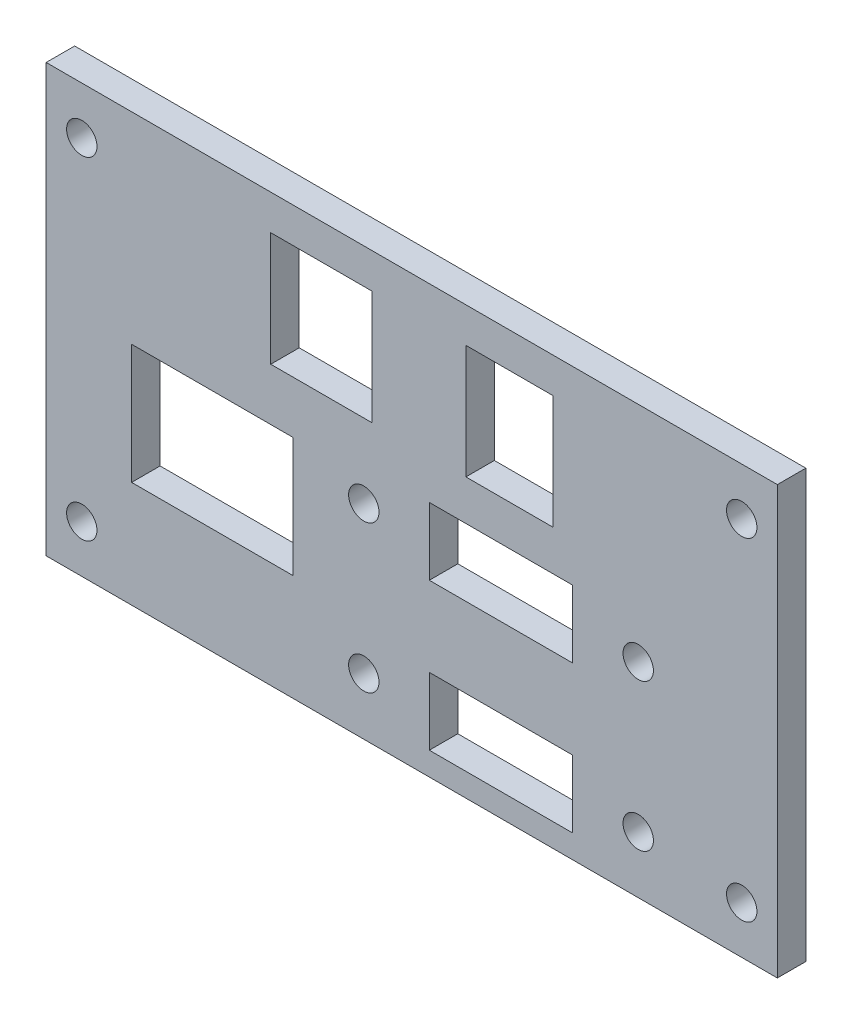
ISO-10303-21;
HEADER;
FILE_DESCRIPTION(('STEP AP214'),'2;1');
FILE_NAME('part.step','',(''),(''),'','','');
FILE_SCHEMA(('AUTOMOTIVE_DESIGN { 1 0 10303 214 1 1 1 1 }'));
ENDSEC;
DATA;
#1=APPLICATION_CONTEXT('core data for automotive mechanical design processes');
#2=APPLICATION_PROTOCOL_DEFINITION('international standard','automotive_design',2000,#1);
#3=PRODUCT_CONTEXT('',#1,'mechanical');
#4=PRODUCT('Part','Part','',(#3));
#5=PRODUCT_RELATED_PRODUCT_CATEGORY('part','',(#4));
#6=PRODUCT_DEFINITION_FORMATION('','',#4);
#7=PRODUCT_DEFINITION_CONTEXT('part definition',#1,'design');
#8=PRODUCT_DEFINITION('design','',#6,#7);
#9=PRODUCT_DEFINITION_SHAPE('','',#8);
#10=(LENGTH_UNIT() NAMED_UNIT(*) SI_UNIT(.MILLI.,.METRE.));
#11=(NAMED_UNIT(*) PLANE_ANGLE_UNIT() SI_UNIT($,.RADIAN.));
#12=(NAMED_UNIT(*) SI_UNIT($,.STERADIAN.) SOLID_ANGLE_UNIT());
#13=UNCERTAINTY_MEASURE_WITH_UNIT(LENGTH_MEASURE(1.E-05),#10,'distance_accuracy_value','');
#14=(GEOMETRIC_REPRESENTATION_CONTEXT(3) GLOBAL_UNCERTAINTY_ASSIGNED_CONTEXT((#13)) GLOBAL_UNIT_ASSIGNED_CONTEXT((#10,
#11,#12)) REPRESENTATION_CONTEXT('',''));
#15=CARTESIAN_POINT('',(0.,0.,0.));
#16=DIRECTION('',(0.,0.,1.));
#17=DIRECTION('',(1.,0.,0.));
#18=AXIS2_PLACEMENT_3D('',#15,#16,#17);
#19=CARTESIAN_POINT('',(0.,0.,3.));
#20=DIRECTION('',(1.,0.,0.));
#21=DIRECTION('',(0.,0.,-1.));
#22=AXIS2_PLACEMENT_3D('',#19,#20,#21);
#23=PLANE('',#22);
#24=DIRECTION('',(0.,-1.,0.));
#25=VECTOR('',#24,1.);
#26=CARTESIAN_POINT('',(0.,0.,0.));
#27=LINE('',#26,#25);
#28=CARTESIAN_POINT('',(0.,45.,0.));
#29=VERTEX_POINT('',#28);
#30=CARTESIAN_POINT('',(0.,0.,0.));
#31=VERTEX_POINT('',#30);
#32=EDGE_CURVE('E374',#29,#31,#27,.T.);
#33=ORIENTED_EDGE('',*,*,#32,.T.);
#34=DIRECTION('',(0.,0.,-1.));
#35=VECTOR('',#34,1.);
#36=CARTESIAN_POINT('',(0.,0.,3.));
#37=LINE('',#36,#35);
#38=CARTESIAN_POINT('',(0.,0.,3.));
#39=VERTEX_POINT('',#38);
#40=EDGE_CURVE('E11',#39,#31,#37,.T.);
#41=ORIENTED_EDGE('',*,*,#40,.F.);
#42=DIRECTION('',(0.,-1.,0.));
#43=VECTOR('',#42,1.);
#44=CARTESIAN_POINT('',(0.,0.,3.));
#45=LINE('',#44,#43);
#46=CARTESIAN_POINT('',(0.,45.,3.));
#47=VERTEX_POINT('',#46);
#48=EDGE_CURVE('E377',#47,#39,#45,.T.);
#49=ORIENTED_EDGE('',*,*,#48,.F.);
#50=DIRECTION('',(0.,0.,-1.));
#51=VECTOR('',#50,1.);
#52=CARTESIAN_POINT('',(0.,45.,3.));
#53=LINE('',#52,#51);
#54=EDGE_CURVE('E387',#47,#29,#53,.T.);
#55=ORIENTED_EDGE('',*,*,#54,.T.);
#56=EDGE_LOOP('',(#33,#41,#49,#55));
#57=FACE_BOUND('',#56,.T.);
#58=ADVANCED_FACE('F30',(#57),#23,.F.);
#59=CARTESIAN_POINT('',(0.,0.,3.));
#60=DIRECTION('',(0.,1.,0.));
#61=DIRECTION('',(0.,0.,1.));
#62=AXIS2_PLACEMENT_3D('',#59,#60,#61);
#63=PLANE('',#62);
#64=DIRECTION('',(1.,0.,0.));
#65=VECTOR('',#64,1.);
#66=CARTESIAN_POINT('',(0.,0.,0.));
#67=LINE('',#66,#65);
#68=CARTESIAN_POINT('',(77.,0.,0.));
#69=VERTEX_POINT('',#68);
#70=EDGE_CURVE('E390',#31,#69,#67,.T.);
#71=ORIENTED_EDGE('',*,*,#70,.T.);
#72=DIRECTION('',(0.,0.,-1.));
#73=VECTOR('',#72,1.);
#74=CARTESIAN_POINT('',(77.,0.,3.));
#75=LINE('',#74,#73);
#76=CARTESIAN_POINT('',(77.,0.,3.));
#77=VERTEX_POINT('',#76);
#78=EDGE_CURVE('E37',#77,#69,#75,.T.);
#79=ORIENTED_EDGE('',*,*,#78,.F.);
#80=DIRECTION('',(1.,0.,0.));
#81=VECTOR('',#80,1.);
#82=CARTESIAN_POINT('',(0.,0.,3.));
#83=LINE('',#82,#81);
#84=EDGE_CURVE('E380',#39,#77,#83,.T.);
#85=ORIENTED_EDGE('',*,*,#84,.F.);
#86=ORIENTED_EDGE('',*,*,#40,.T.);
#87=EDGE_LOOP('',(#71,#79,#85,#86));
#88=FACE_BOUND('',#87,.T.);
#89=ADVANCED_FACE('F419',(#88),#63,.F.);
#90=CARTESIAN_POINT('',(77.,0.,3.));
#91=DIRECTION('',(-1.,0.,0.));
#92=DIRECTION('',(0.,-1.,0.));
#93=AXIS2_PLACEMENT_3D('',#90,#91,#92);
#94=PLANE('',#93);
#95=DIRECTION('',(0.,1.,0.));
#96=VECTOR('',#95,1.);
#97=CARTESIAN_POINT('',(77.,0.,0.));
#98=LINE('',#97,#96);
#99=CARTESIAN_POINT('',(77.,45.,0.));
#100=VERTEX_POINT('',#99);
#101=EDGE_CURVE('E392',#69,#100,#98,.T.);
#102=ORIENTED_EDGE('',*,*,#101,.T.);
#103=DIRECTION('',(0.,0.,-1.));
#104=VECTOR('',#103,1.);
#105=CARTESIAN_POINT('',(77.,45.,3.));
#106=LINE('',#105,#104);
#107=CARTESIAN_POINT('',(77.,45.,3.));
#108=VERTEX_POINT('',#107);
#109=EDGE_CURVE('E397',#108,#100,#106,.T.);
#110=ORIENTED_EDGE('',*,*,#109,.F.);
#111=DIRECTION('',(0.,1.,0.));
#112=VECTOR('',#111,1.);
#113=CARTESIAN_POINT('',(77.,0.,3.));
#114=LINE('',#113,#112);
#115=EDGE_CURVE('E383',#77,#108,#114,.T.);
#116=ORIENTED_EDGE('',*,*,#115,.F.);
#117=ORIENTED_EDGE('',*,*,#78,.T.);
#118=EDGE_LOOP('',(#102,#110,#116,#117));
#119=FACE_BOUND('',#118,.T.);
#120=ADVANCED_FACE('F404',(#119),#94,.F.);
#121=CARTESIAN_POINT('',(0.,45.,3.));
#122=DIRECTION('',(0.,-1.,0.));
#123=DIRECTION('',(0.,0.,-1.));
#124=AXIS2_PLACEMENT_3D('',#121,#122,#123);
#125=PLANE('',#124);
#126=DIRECTION('',(-1.,0.,0.));
#127=VECTOR('',#126,1.);
#128=CARTESIAN_POINT('',(0.,45.,0.));
#129=LINE('',#128,#127);
#130=EDGE_CURVE('E381',#100,#29,#129,.T.);
#131=ORIENTED_EDGE('',*,*,#130,.T.);
#132=ORIENTED_EDGE('',*,*,#54,.F.);
#133=DIRECTION('',(-1.,0.,0.));
#134=VECTOR('',#133,1.);
#135=CARTESIAN_POINT('',(0.,45.,3.));
#136=LINE('',#135,#134);
#137=EDGE_CURVE('E385',#108,#47,#136,.T.);
#138=ORIENTED_EDGE('',*,*,#137,.F.);
#139=ORIENTED_EDGE('',*,*,#109,.T.);
#140=EDGE_LOOP('',(#131,#132,#138,#139));
#141=FACE_BOUND('',#140,.T.);
#142=ADVANCED_FACE('F412',(#141),#125,.F.);
#143=CARTESIAN_POINT('',(0.,45.,3.));
#144=DIRECTION('',(0.,0.,-1.));
#145=DIRECTION('',(-1.,0.,0.));
#146=AXIS2_PLACEMENT_3D('',#143,#144,#145);
#147=PLANE('',#146);
#148=CARTESIAN_POINT('',(62.35,6.,3.));
#149=DIRECTION('',(0.,0.,1.));
#150=DIRECTION('',(1.,0.,0.));
#151=AXIS2_PLACEMENT_3D('',#148,#149,#150);
#152=CIRCLE('',#151,1.60000000000001);
#153=CARTESIAN_POINT('',(63.95,6.,3.));
#154=VERTEX_POINT('',#153);
#155=EDGE_CURVE('E550',#154,#154,#152,.T.);
#156=ORIENTED_EDGE('',*,*,#155,.F.);
#157=EDGE_LOOP('',(#156));
#158=FACE_BOUND('',#157,.T.);
#159=CARTESIAN_POINT('',(62.35,21.5,3.));
#160=DIRECTION('',(0.,0.,1.));
#161=DIRECTION('',(1.,0.,0.));
#162=AXIS2_PLACEMENT_3D('',#159,#160,#161);
#163=CIRCLE('',#162,1.60000000000003);
#164=CARTESIAN_POINT('',(63.95,21.5,3.));
#165=VERTEX_POINT('',#164);
#166=EDGE_CURVE('E554',#165,#165,#163,.T.);
#167=ORIENTED_EDGE('',*,*,#166,.F.);
#168=EDGE_LOOP('',(#167));
#169=FACE_BOUND('',#168,.T.);
#170=CARTESIAN_POINT('',(33.45,6.,3.));
#171=DIRECTION('',(0.,0.,1.));
#172=DIRECTION('',(1.,0.,0.));
#173=AXIS2_PLACEMENT_3D('',#170,#171,#172);
#174=CIRCLE('',#173,1.6);
#175=CARTESIAN_POINT('',(35.05,6.,3.));
#176=VERTEX_POINT('',#175);
#177=EDGE_CURVE('E561',#176,#176,#174,.T.);
#178=ORIENTED_EDGE('',*,*,#177,.F.);
#179=EDGE_LOOP('',(#178));
#180=FACE_BOUND('',#179,.T.);
#181=CARTESIAN_POINT('',(33.45,21.5,3.));
#182=DIRECTION('',(0.,0.,1.));
#183=DIRECTION('',(1.,0.,0.));
#184=AXIS2_PLACEMENT_3D('',#181,#182,#183);
#185=CIRCLE('',#184,1.59999999999999);
#186=CARTESIAN_POINT('',(35.05,21.5,3.));
#187=VERTEX_POINT('',#186);
#188=EDGE_CURVE('E567',#187,#187,#185,.T.);
#189=ORIENTED_EDGE('',*,*,#188,.F.);
#190=EDGE_LOOP('',(#189));
#191=FACE_BOUND('',#190,.T.);
#192=DIRECTION('',(1.,0.,0.));
#193=VECTOR('',#192,1.);
#194=CARTESIAN_POINT('',(40.35,2.45,3.));
#195=LINE('',#194,#193);
#196=CARTESIAN_POINT('',(40.35,2.45,3.));
#197=VERTEX_POINT('',#196);
#198=CARTESIAN_POINT('',(55.45,2.45,3.));
#199=VERTEX_POINT('',#198);
#200=EDGE_CURVE('E209',#197,#199,#195,.T.);
#201=ORIENTED_EDGE('',*,*,#200,.F.);
#202=DIRECTION('',(0.,-1.,0.));
#203=VECTOR('',#202,1.);
#204=CARTESIAN_POINT('',(40.35,2.45,3.));
#205=LINE('',#204,#203);
#206=CARTESIAN_POINT('',(40.35,9.55,3.));
#207=VERTEX_POINT('',#206);
#208=EDGE_CURVE('E44',#207,#197,#205,.T.);
#209=ORIENTED_EDGE('',*,*,#208,.F.);
#210=DIRECTION('',(-1.,0.,0.));
#211=VECTOR('',#210,1.);
#212=CARTESIAN_POINT('',(40.35,9.55,3.));
#213=LINE('',#212,#211);
#214=CARTESIAN_POINT('',(55.45,9.55000000000001,3.));
#215=VERTEX_POINT('',#214);
#216=EDGE_CURVE('E202',#215,#207,#213,.T.);
#217=ORIENTED_EDGE('',*,*,#216,.F.);
#218=DIRECTION('',(0.,1.,0.));
#219=VECTOR('',#218,1.);
#220=CARTESIAN_POINT('',(55.45,2.45,3.));
#221=LINE('',#220,#219);
#222=EDGE_CURVE('E216',#199,#215,#221,.T.);
#223=ORIENTED_EDGE('',*,*,#222,.F.);
#224=EDGE_LOOP('',(#201,#209,#217,#223));
#225=FACE_BOUND('',#224,.T.);
#226=DIRECTION('',(1.,0.,0.));
#227=VECTOR('',#226,1.);
#228=CARTESIAN_POINT('',(40.35,17.95,3.));
#229=LINE('',#228,#227);
#230=CARTESIAN_POINT('',(40.35,17.95,3.));
#231=VERTEX_POINT('',#230);
#232=CARTESIAN_POINT('',(55.45,17.95,3.));
#233=VERTEX_POINT('',#232);
#234=EDGE_CURVE('E235',#231,#233,#229,.T.);
#235=ORIENTED_EDGE('',*,*,#234,.F.);
#236=DIRECTION('',(0.,-1.,0.));
#237=VECTOR('',#236,1.);
#238=CARTESIAN_POINT('',(40.35,25.05,3.));
#239=LINE('',#238,#237);
#240=CARTESIAN_POINT('',(40.35,25.05,3.));
#241=VERTEX_POINT('',#240);
#242=EDGE_CURVE('E233',#241,#231,#239,.T.);
#243=ORIENTED_EDGE('',*,*,#242,.F.);
#244=DIRECTION('',(-1.,0.,0.));
#245=VECTOR('',#244,1.);
#246=CARTESIAN_POINT('',(40.35,25.05,3.));
#247=LINE('',#246,#245);
#248=CARTESIAN_POINT('',(55.45,25.05,3.));
#249=VERTEX_POINT('',#248);
#250=EDGE_CURVE('E241',#249,#241,#247,.T.);
#251=ORIENTED_EDGE('',*,*,#250,.F.);
#252=DIRECTION('',(0.,1.,0.));
#253=VECTOR('',#252,1.);
#254=CARTESIAN_POINT('',(55.45,25.05,3.));
#255=LINE('',#254,#253);
#256=EDGE_CURVE('E238',#233,#249,#255,.T.);
#257=ORIENTED_EDGE('',*,*,#256,.F.);
#258=EDGE_LOOP('',(#235,#243,#251,#257));
#259=FACE_BOUND('',#258,.T.);
#260=DIRECTION('',(1.,0.,0.));
#261=VECTOR('',#260,1.);
#262=CARTESIAN_POINT('',(44.2,29.3,3.));
#263=LINE('',#262,#261);
#264=CARTESIAN_POINT('',(44.2,29.3,3.));
#265=VERTEX_POINT('',#264);
#266=CARTESIAN_POINT('',(53.35,29.3,3.));
#267=VERTEX_POINT('',#266);
#268=EDGE_CURVE('E267',#265,#267,#263,.T.);
#269=ORIENTED_EDGE('',*,*,#268,.F.);
#270=DIRECTION('',(0.,-1.,0.));
#271=VECTOR('',#270,1.);
#272=CARTESIAN_POINT('',(44.2,41.3,3.));
#273=LINE('',#272,#271);
#274=CARTESIAN_POINT('',(44.2,41.3,3.));
#275=VERTEX_POINT('',#274);
#276=EDGE_CURVE('E265',#275,#265,#273,.T.);
#277=ORIENTED_EDGE('',*,*,#276,.F.);
#278=DIRECTION('',(-1.,0.,0.));
#279=VECTOR('',#278,1.);
#280=CARTESIAN_POINT('',(44.2,41.3,3.));
#281=LINE('',#280,#279);
#282=CARTESIAN_POINT('',(53.35,41.3,3.));
#283=VERTEX_POINT('',#282);
#284=EDGE_CURVE('E273',#283,#275,#281,.T.);
#285=ORIENTED_EDGE('',*,*,#284,.F.);
#286=DIRECTION('',(0.,1.,0.));
#287=VECTOR('',#286,1.);
#288=CARTESIAN_POINT('',(53.35,41.3,3.));
#289=LINE('',#288,#287);
#290=EDGE_CURVE('E270',#267,#283,#289,.T.);
#291=ORIENTED_EDGE('',*,*,#290,.F.);
#292=EDGE_LOOP('',(#269,#277,#285,#291));
#293=FACE_BOUND('',#292,.T.);
#294=DIRECTION('',(1.,0.,0.));
#295=VECTOR('',#294,1.);
#296=CARTESIAN_POINT('',(23.65,29.3,3.));
#297=LINE('',#296,#295);
#298=CARTESIAN_POINT('',(23.65,29.3,3.));
#299=VERTEX_POINT('',#298);
#300=CARTESIAN_POINT('',(34.3,29.3,3.));
#301=VERTEX_POINT('',#300);
#302=EDGE_CURVE('E299',#299,#301,#297,.T.);
#303=ORIENTED_EDGE('',*,*,#302,.F.);
#304=DIRECTION('',(0.,-1.,0.));
#305=VECTOR('',#304,1.);
#306=CARTESIAN_POINT('',(23.65,41.3,3.));
#307=LINE('',#306,#305);
#308=CARTESIAN_POINT('',(23.65,41.3,3.));
#309=VERTEX_POINT('',#308);
#310=EDGE_CURVE('E297',#309,#299,#307,.T.);
#311=ORIENTED_EDGE('',*,*,#310,.F.);
#312=DIRECTION('',(-1.,0.,0.));
#313=VECTOR('',#312,1.);
#314=CARTESIAN_POINT('',(23.65,41.3,3.));
#315=LINE('',#314,#313);
#316=CARTESIAN_POINT('',(34.3,41.3,3.));
#317=VERTEX_POINT('',#316);
#318=EDGE_CURVE('E305',#317,#309,#315,.T.);
#319=ORIENTED_EDGE('',*,*,#318,.F.);
#320=DIRECTION('',(0.,1.,0.));
#321=VECTOR('',#320,1.);
#322=CARTESIAN_POINT('',(34.3,41.3,3.));
#323=LINE('',#322,#321);
#324=EDGE_CURVE('E302',#301,#317,#323,.T.);
#325=ORIENTED_EDGE('',*,*,#324,.F.);
#326=EDGE_LOOP('',(#303,#311,#319,#325));
#327=FACE_BOUND('',#326,.T.);
#328=DIRECTION('',(1.,0.,0.));
#329=VECTOR('',#328,1.);
#330=CARTESIAN_POINT('',(9.00000000000001,11.2,3.));
#331=LINE('',#330,#329);
#332=CARTESIAN_POINT('',(9.00000000000001,11.2,3.));
#333=VERTEX_POINT('',#332);
#334=CARTESIAN_POINT('',(26.,11.2,3.));
#335=VERTEX_POINT('',#334);
#336=EDGE_CURVE('E331',#333,#335,#331,.T.);
#337=ORIENTED_EDGE('',*,*,#336,.F.);
#338=DIRECTION('',(0.,-1.,0.));
#339=VECTOR('',#338,1.);
#340=CARTESIAN_POINT('',(9.,23.8,3.));
#341=LINE('',#340,#339);
#342=CARTESIAN_POINT('',(9.,23.8,3.));
#343=VERTEX_POINT('',#342);
#344=EDGE_CURVE('E329',#343,#333,#341,.T.);
#345=ORIENTED_EDGE('',*,*,#344,.F.);
#346=DIRECTION('',(-1.,0.,0.));
#347=VECTOR('',#346,1.);
#348=CARTESIAN_POINT('',(9.,23.8,3.));
#349=LINE('',#348,#347);
#350=CARTESIAN_POINT('',(26.,23.8,3.));
#351=VERTEX_POINT('',#350);
#352=EDGE_CURVE('E337',#351,#343,#349,.T.);
#353=ORIENTED_EDGE('',*,*,#352,.F.);
#354=DIRECTION('',(0.,1.,0.));
#355=VECTOR('',#354,1.);
#356=CARTESIAN_POINT('',(26.,23.8,3.));
#357=LINE('',#356,#355);
#358=EDGE_CURVE('E334',#335,#351,#357,.T.);
#359=ORIENTED_EDGE('',*,*,#358,.F.);
#360=EDGE_LOOP('',(#337,#345,#353,#359));
#361=FACE_BOUND('',#360,.T.);
#362=CARTESIAN_POINT('',(73.25,40.,3.));
#363=DIRECTION('',(0.,0.,1.));
#364=DIRECTION('',(1.,0.,0.));
#365=AXIS2_PLACEMENT_3D('',#362,#363,#364);
#366=CIRCLE('',#365,1.60000000000001);
#367=CARTESIAN_POINT('',(74.85,40.,3.));
#368=VERTEX_POINT('',#367);
#369=EDGE_CURVE('E353',#368,#368,#366,.T.);
#370=ORIENTED_EDGE('',*,*,#369,.F.);
#371=EDGE_LOOP('',(#370));
#372=FACE_BOUND('',#371,.T.);
#373=CARTESIAN_POINT('',(73.25,4.99999999999999,3.));
#374=DIRECTION('',(0.,0.,1.));
#375=DIRECTION('',(1.,0.,0.));
#376=AXIS2_PLACEMENT_3D('',#373,#374,#375);
#377=CIRCLE('',#376,1.60000000000001);
#378=CARTESIAN_POINT('',(74.85,4.99999999999999,3.));
#379=VERTEX_POINT('',#378);
#380=EDGE_CURVE('E359',#379,#379,#377,.T.);
#381=ORIENTED_EDGE('',*,*,#380,.F.);
#382=EDGE_LOOP('',(#381));
#383=FACE_BOUND('',#382,.T.);
#384=CARTESIAN_POINT('',(3.74999999999999,4.99999999999999,3.));
#385=DIRECTION('',(0.,0.,1.));
#386=DIRECTION('',(1.,0.,0.));
#387=AXIS2_PLACEMENT_3D('',#384,#385,#386);
#388=CIRCLE('',#387,1.6);
#389=CARTESIAN_POINT('',(5.34999999999999,4.99999999999999,3.));
#390=VERTEX_POINT('',#389);
#391=EDGE_CURVE('E365',#390,#390,#388,.T.);
#392=ORIENTED_EDGE('',*,*,#391,.F.);
#393=EDGE_LOOP('',(#392));
#394=FACE_BOUND('',#393,.T.);
#395=CARTESIAN_POINT('',(3.74999999999999,40.,3.));
#396=DIRECTION('',(0.,0.,1.));
#397=DIRECTION('',(1.,0.,0.));
#398=AXIS2_PLACEMENT_3D('',#395,#396,#397);
#399=CIRCLE('',#398,1.6);
#400=CARTESIAN_POINT('',(5.34999999999999,40.,3.));
#401=VERTEX_POINT('',#400);
#402=EDGE_CURVE('E371',#401,#401,#399,.T.);
#403=ORIENTED_EDGE('',*,*,#402,.F.);
#404=EDGE_LOOP('',(#403));
#405=FACE_BOUND('',#404,.T.);
#406=ORIENTED_EDGE('',*,*,#48,.T.);
#407=ORIENTED_EDGE('',*,*,#84,.T.);
#408=ORIENTED_EDGE('',*,*,#115,.T.);
#409=ORIENTED_EDGE('',*,*,#137,.T.);
#410=EDGE_LOOP('',(#406,#407,#408,#409));
#411=FACE_BOUND('',#410,.T.);
#412=ADVANCED_FACE('F418',(#158,#169,#180,#191,#225,#259,#293,#327,#361,#372,#383,#394,#405,
#411),#147,.F.);
#413=CARTESIAN_POINT('',(0.,45.,0.));
#414=DIRECTION('',(0.,0.,-1.));
#415=DIRECTION('',(-1.,0.,0.));
#416=AXIS2_PLACEMENT_3D('',#413,#414,#415);
#417=PLANE('',#416);
#418=CARTESIAN_POINT('',(62.35,6.,0.));
#419=DIRECTION('',(0.,0.,-1.));
#420=DIRECTION('',(-1.,0.,0.));
#421=AXIS2_PLACEMENT_3D('',#418,#419,#420);
#422=CIRCLE('',#421,1.60000000000001);
#423=CARTESIAN_POINT('',(60.75,6.,0.));
#424=VERTEX_POINT('',#423);
#425=EDGE_CURVE('E547',#424,#424,#422,.F.);
#426=ORIENTED_EDGE('',*,*,#425,.T.);
#427=EDGE_LOOP('',(#426));
#428=FACE_BOUND('',#427,.T.);
#429=CARTESIAN_POINT('',(62.35,21.5,0.));
#430=DIRECTION('',(0.,0.,-1.));
#431=DIRECTION('',(-1.,0.,0.));
#432=AXIS2_PLACEMENT_3D('',#429,#430,#431);
#433=CIRCLE('',#432,1.60000000000003);
#434=CARTESIAN_POINT('',(60.75,21.5,0.));
#435=VERTEX_POINT('',#434);
#436=EDGE_CURVE('E551',#435,#435,#433,.F.);
#437=ORIENTED_EDGE('',*,*,#436,.T.);
#438=EDGE_LOOP('',(#437));
#439=FACE_BOUND('',#438,.T.);
#440=CARTESIAN_POINT('',(33.45,6.,0.));
#441=DIRECTION('',(0.,0.,-1.));
#442=DIRECTION('',(-1.,0.,0.));
#443=AXIS2_PLACEMENT_3D('',#440,#441,#442);
#444=CIRCLE('',#443,1.6);
#445=CARTESIAN_POINT('',(31.85,6.,0.));
#446=VERTEX_POINT('',#445);
#447=EDGE_CURVE('E559',#446,#446,#444,.F.);
#448=ORIENTED_EDGE('',*,*,#447,.T.);
#449=EDGE_LOOP('',(#448));
#450=FACE_BOUND('',#449,.T.);
#451=CARTESIAN_POINT('',(33.45,21.5,0.));
#452=DIRECTION('',(0.,0.,-1.));
#453=DIRECTION('',(-1.,0.,0.));
#454=AXIS2_PLACEMENT_3D('',#451,#452,#453);
#455=CIRCLE('',#454,1.59999999999999);
#456=CARTESIAN_POINT('',(31.85,21.5,0.));
#457=VERTEX_POINT('',#456);
#458=EDGE_CURVE('E564',#457,#457,#455,.F.);
#459=ORIENTED_EDGE('',*,*,#458,.T.);
#460=EDGE_LOOP('',(#459));
#461=FACE_BOUND('',#460,.T.);
#462=DIRECTION('',(0.,-1.,0.));
#463=VECTOR('',#462,1.);
#464=CARTESIAN_POINT('',(40.35,2.45,0.));
#465=LINE('',#464,#463);
#466=CARTESIAN_POINT('',(40.35,9.55,0.));
#467=VERTEX_POINT('',#466);
#468=CARTESIAN_POINT('',(40.35,2.45,0.));
#469=VERTEX_POINT('',#468);
#470=EDGE_CURVE('E200',#467,#469,#465,.T.);
#471=ORIENTED_EDGE('',*,*,#470,.T.);
#472=DIRECTION('',(1.,0.,0.));
#473=VECTOR('',#472,1.);
#474=CARTESIAN_POINT('',(40.35,2.45,0.));
#475=LINE('',#474,#473);
#476=CARTESIAN_POINT('',(55.45,2.45,0.));
#477=VERTEX_POINT('',#476);
#478=EDGE_CURVE('E189',#469,#477,#475,.T.);
#479=ORIENTED_EDGE('',*,*,#478,.T.);
#480=DIRECTION('',(0.,1.,0.));
#481=VECTOR('',#480,1.);
#482=CARTESIAN_POINT('',(55.45,2.45,0.));
#483=LINE('',#482,#481);
#484=CARTESIAN_POINT('',(55.45,9.55000000000001,0.));
#485=VERTEX_POINT('',#484);
#486=EDGE_CURVE('E211',#477,#485,#483,.T.);
#487=ORIENTED_EDGE('',*,*,#486,.T.);
#488=DIRECTION('',(-1.,0.,0.));
#489=VECTOR('',#488,1.);
#490=CARTESIAN_POINT('',(40.35,9.55,0.));
#491=LINE('',#490,#489);
#492=EDGE_CURVE('E207',#485,#467,#491,.T.);
#493=ORIENTED_EDGE('',*,*,#492,.T.);
#494=EDGE_LOOP('',(#471,#479,#487,#493));
#495=FACE_BOUND('',#494,.T.);
#496=DIRECTION('',(0.,-1.,0.));
#497=VECTOR('',#496,1.);
#498=CARTESIAN_POINT('',(40.35,25.05,0.));
#499=LINE('',#498,#497);
#500=CARTESIAN_POINT('',(40.35,25.05,0.));
#501=VERTEX_POINT('',#500);
#502=CARTESIAN_POINT('',(40.35,17.95,0.));
#503=VERTEX_POINT('',#502);
#504=EDGE_CURVE('E230',#501,#503,#499,.T.);
#505=ORIENTED_EDGE('',*,*,#504,.T.);
#506=DIRECTION('',(1.,0.,0.));
#507=VECTOR('',#506,1.);
#508=CARTESIAN_POINT('',(40.35,17.95,0.));
#509=LINE('',#508,#507);
#510=CARTESIAN_POINT('',(55.45,17.95,0.));
#511=VERTEX_POINT('',#510);
#512=EDGE_CURVE('E247',#503,#511,#509,.T.);
#513=ORIENTED_EDGE('',*,*,#512,.T.);
#514=DIRECTION('',(0.,1.,0.));
#515=VECTOR('',#514,1.);
#516=CARTESIAN_POINT('',(55.45,25.05,0.));
#517=LINE('',#516,#515);
#518=CARTESIAN_POINT('',(55.45,25.05,0.));
#519=VERTEX_POINT('',#518);
#520=EDGE_CURVE('E196',#511,#519,#517,.T.);
#521=ORIENTED_EDGE('',*,*,#520,.T.);
#522=DIRECTION('',(-1.,0.,0.));
#523=VECTOR('',#522,1.);
#524=CARTESIAN_POINT('',(40.35,25.05,0.));
#525=LINE('',#524,#523);
#526=EDGE_CURVE('E227',#519,#501,#525,.T.);
#527=ORIENTED_EDGE('',*,*,#526,.T.);
#528=EDGE_LOOP('',(#505,#513,#521,#527));
#529=FACE_BOUND('',#528,.T.);
#530=DIRECTION('',(0.,-1.,0.));
#531=VECTOR('',#530,1.);
#532=CARTESIAN_POINT('',(44.2,41.3,0.));
#533=LINE('',#532,#531);
#534=CARTESIAN_POINT('',(44.2,41.3,0.));
#535=VERTEX_POINT('',#534);
#536=CARTESIAN_POINT('',(44.2,29.3,0.));
#537=VERTEX_POINT('',#536);
#538=EDGE_CURVE('E262',#535,#537,#533,.T.);
#539=ORIENTED_EDGE('',*,*,#538,.T.);
#540=DIRECTION('',(1.,0.,0.));
#541=VECTOR('',#540,1.);
#542=CARTESIAN_POINT('',(44.2,29.3,0.));
#543=LINE('',#542,#541);
#544=CARTESIAN_POINT('',(53.35,29.3,0.));
#545=VERTEX_POINT('',#544);
#546=EDGE_CURVE('E279',#537,#545,#543,.T.);
#547=ORIENTED_EDGE('',*,*,#546,.T.);
#548=DIRECTION('',(0.,1.,0.));
#549=VECTOR('',#548,1.);
#550=CARTESIAN_POINT('',(53.35,41.3,0.));
#551=LINE('',#550,#549);
#552=CARTESIAN_POINT('',(53.35,41.3,0.));
#553=VERTEX_POINT('',#552);
#554=EDGE_CURVE('E256',#545,#553,#551,.T.);
#555=ORIENTED_EDGE('',*,*,#554,.T.);
#556=DIRECTION('',(-1.,0.,0.));
#557=VECTOR('',#556,1.);
#558=CARTESIAN_POINT('',(44.2,41.3,0.));
#559=LINE('',#558,#557);
#560=EDGE_CURVE('E259',#553,#535,#559,.T.);
#561=ORIENTED_EDGE('',*,*,#560,.T.);
#562=EDGE_LOOP('',(#539,#547,#555,#561));
#563=FACE_BOUND('',#562,.T.);
#564=DIRECTION('',(0.,-1.,0.));
#565=VECTOR('',#564,1.);
#566=CARTESIAN_POINT('',(23.65,41.3,0.));
#567=LINE('',#566,#565);
#568=CARTESIAN_POINT('',(23.65,41.3,0.));
#569=VERTEX_POINT('',#568);
#570=CARTESIAN_POINT('',(23.65,29.3,0.));
#571=VERTEX_POINT('',#570);
#572=EDGE_CURVE('E294',#569,#571,#567,.T.);
#573=ORIENTED_EDGE('',*,*,#572,.T.);
#574=DIRECTION('',(1.,0.,0.));
#575=VECTOR('',#574,1.);
#576=CARTESIAN_POINT('',(23.65,29.3,0.));
#577=LINE('',#576,#575);
#578=CARTESIAN_POINT('',(34.3,29.3,0.));
#579=VERTEX_POINT('',#578);
#580=EDGE_CURVE('E311',#571,#579,#577,.T.);
#581=ORIENTED_EDGE('',*,*,#580,.T.);
#582=DIRECTION('',(0.,1.,0.));
#583=VECTOR('',#582,1.);
#584=CARTESIAN_POINT('',(34.3,41.3,0.));
#585=LINE('',#584,#583);
#586=CARTESIAN_POINT('',(34.3,41.3,0.));
#587=VERTEX_POINT('',#586);
#588=EDGE_CURVE('E288',#579,#587,#585,.T.);
#589=ORIENTED_EDGE('',*,*,#588,.T.);
#590=DIRECTION('',(-1.,0.,0.));
#591=VECTOR('',#590,1.);
#592=CARTESIAN_POINT('',(23.65,41.3,0.));
#593=LINE('',#592,#591);
#594=EDGE_CURVE('E291',#587,#569,#593,.T.);
#595=ORIENTED_EDGE('',*,*,#594,.T.);
#596=EDGE_LOOP('',(#573,#581,#589,#595));
#597=FACE_BOUND('',#596,.T.);
#598=DIRECTION('',(0.,-1.,0.));
#599=VECTOR('',#598,1.);
#600=CARTESIAN_POINT('',(9.,23.8,0.));
#601=LINE('',#600,#599);
#602=CARTESIAN_POINT('',(9.,23.8,0.));
#603=VERTEX_POINT('',#602);
#604=CARTESIAN_POINT('',(9.00000000000001,11.2,0.));
#605=VERTEX_POINT('',#604);
#606=EDGE_CURVE('E326',#603,#605,#601,.T.);
#607=ORIENTED_EDGE('',*,*,#606,.T.);
#608=DIRECTION('',(1.,0.,0.));
#609=VECTOR('',#608,1.);
#610=CARTESIAN_POINT('',(9.00000000000001,11.2,0.));
#611=LINE('',#610,#609);
#612=CARTESIAN_POINT('',(26.,11.2,0.));
#613=VERTEX_POINT('',#612);
#614=EDGE_CURVE('E343',#605,#613,#611,.T.);
#615=ORIENTED_EDGE('',*,*,#614,.T.);
#616=DIRECTION('',(0.,1.,0.));
#617=VECTOR('',#616,1.);
#618=CARTESIAN_POINT('',(26.,23.8,0.));
#619=LINE('',#618,#617);
#620=CARTESIAN_POINT('',(26.,23.8,0.));
#621=VERTEX_POINT('',#620);
#622=EDGE_CURVE('E320',#613,#621,#619,.T.);
#623=ORIENTED_EDGE('',*,*,#622,.T.);
#624=DIRECTION('',(-1.,0.,0.));
#625=VECTOR('',#624,1.);
#626=CARTESIAN_POINT('',(9.,23.8,0.));
#627=LINE('',#626,#625);
#628=EDGE_CURVE('E323',#621,#603,#627,.T.);
#629=ORIENTED_EDGE('',*,*,#628,.T.);
#630=EDGE_LOOP('',(#607,#615,#623,#629));
#631=FACE_BOUND('',#630,.T.);
#632=CARTESIAN_POINT('',(73.25,40.,0.));
#633=DIRECTION('',(0.,0.,-1.));
#634=DIRECTION('',(-1.,0.,0.));
#635=AXIS2_PLACEMENT_3D('',#632,#633,#634);
#636=CIRCLE('',#635,1.60000000000001);
#637=CARTESIAN_POINT('',(71.65,40.,0.));
#638=VERTEX_POINT('',#637);
#639=EDGE_CURVE('E352',#638,#638,#636,.F.);
#640=ORIENTED_EDGE('',*,*,#639,.T.);
#641=EDGE_LOOP('',(#640));
#642=FACE_BOUND('',#641,.T.);
#643=CARTESIAN_POINT('',(73.25,4.99999999999999,0.));
#644=DIRECTION('',(0.,0.,-1.));
#645=DIRECTION('',(-1.,0.,0.));
#646=AXIS2_PLACEMENT_3D('',#643,#644,#645);
#647=CIRCLE('',#646,1.60000000000001);
#648=CARTESIAN_POINT('',(71.65,4.99999999999999,0.));
#649=VERTEX_POINT('',#648);
#650=EDGE_CURVE('E356',#649,#649,#647,.F.);
#651=ORIENTED_EDGE('',*,*,#650,.T.);
#652=EDGE_LOOP('',(#651));
#653=FACE_BOUND('',#652,.T.);
#654=CARTESIAN_POINT('',(3.74999999999999,4.99999999999999,0.));
#655=DIRECTION('',(0.,0.,-1.));
#656=DIRECTION('',(-1.,0.,0.));
#657=AXIS2_PLACEMENT_3D('',#654,#655,#656);
#658=CIRCLE('',#657,1.6);
#659=CARTESIAN_POINT('',(2.14999999999999,4.99999999999999,0.));
#660=VERTEX_POINT('',#659);
#661=EDGE_CURVE('E362',#660,#660,#658,.F.);
#662=ORIENTED_EDGE('',*,*,#661,.T.);
#663=EDGE_LOOP('',(#662));
#664=FACE_BOUND('',#663,.T.);
#665=CARTESIAN_POINT('',(3.74999999999999,40.,0.));
#666=DIRECTION('',(0.,0.,-1.));
#667=DIRECTION('',(-1.,0.,0.));
#668=AXIS2_PLACEMENT_3D('',#665,#666,#667);
#669=CIRCLE('',#668,1.6);
#670=CARTESIAN_POINT('',(2.14999999999999,40.,0.));
#671=VERTEX_POINT('',#670);
#672=EDGE_CURVE('E368',#671,#671,#669,.F.);
#673=ORIENTED_EDGE('',*,*,#672,.T.);
#674=EDGE_LOOP('',(#673));
#675=FACE_BOUND('',#674,.T.);
#676=ORIENTED_EDGE('',*,*,#32,.F.);
#677=ORIENTED_EDGE('',*,*,#130,.F.);
#678=ORIENTED_EDGE('',*,*,#101,.F.);
#679=ORIENTED_EDGE('',*,*,#70,.F.);
#680=EDGE_LOOP('',(#676,#677,#678,#679));
#681=FACE_BOUND('',#680,.T.);
#682=ADVANCED_FACE('F205',(#428,#439,#450,#461,#495,#529,#563,#597,#631,#642,#653,#664,#675,
#681),#417,.T.);
#683=CARTESIAN_POINT('',(3.74999999999999,40.,-0.00100000000000013));
#684=DIRECTION('',(0.,0.,1.));
#685=DIRECTION('',(1.,0.,0.));
#686=AXIS2_PLACEMENT_3D('',#683,#684,#685);
#687=CYLINDRICAL_SURFACE('',#686,1.6);
#688=ORIENTED_EDGE('',*,*,#672,.F.);
#689=EDGE_LOOP('',(#688));
#690=FACE_BOUND('',#689,.T.);
#691=ORIENTED_EDGE('',*,*,#402,.T.);
#692=EDGE_LOOP('',(#691));
#693=FACE_BOUND('',#692,.T.);
#694=ADVANCED_FACE('F431',(#690,#693),#687,.F.);
#695=CARTESIAN_POINT('',(3.74999999999999,4.99999999999999,-0.00100000000000013));
#696=DIRECTION('',(0.,0.,1.));
#697=DIRECTION('',(1.,0.,0.));
#698=AXIS2_PLACEMENT_3D('',#695,#696,#697);
#699=CYLINDRICAL_SURFACE('',#698,1.6);
#700=ORIENTED_EDGE('',*,*,#661,.F.);
#701=EDGE_LOOP('',(#700));
#702=FACE_BOUND('',#701,.T.);
#703=ORIENTED_EDGE('',*,*,#391,.T.);
#704=EDGE_LOOP('',(#703));
#705=FACE_BOUND('',#704,.T.);
#706=ADVANCED_FACE('F438',(#702,#705),#699,.F.);
#707=CARTESIAN_POINT('',(73.25,4.99999999999999,-0.00100000000000013));
#708=DIRECTION('',(0.,0.,1.));
#709=DIRECTION('',(1.,0.,0.));
#710=AXIS2_PLACEMENT_3D('',#707,#708,#709);
#711=CYLINDRICAL_SURFACE('',#710,1.60000000000001);
#712=ORIENTED_EDGE('',*,*,#650,.F.);
#713=EDGE_LOOP('',(#712));
#714=FACE_BOUND('',#713,.T.);
#715=ORIENTED_EDGE('',*,*,#380,.T.);
#716=EDGE_LOOP('',(#715));
#717=FACE_BOUND('',#716,.T.);
#718=ADVANCED_FACE('F442',(#714,#717),#711,.F.);
#719=CARTESIAN_POINT('',(73.25,40.,-0.00100000000000013));
#720=DIRECTION('',(0.,0.,1.));
#721=DIRECTION('',(1.,0.,0.));
#722=AXIS2_PLACEMENT_3D('',#719,#720,#721);
#723=CYLINDRICAL_SURFACE('',#722,1.60000000000001);
#724=ORIENTED_EDGE('',*,*,#639,.F.);
#725=EDGE_LOOP('',(#724));
#726=FACE_BOUND('',#725,.T.);
#727=ORIENTED_EDGE('',*,*,#369,.T.);
#728=EDGE_LOOP('',(#727));
#729=FACE_BOUND('',#728,.T.);
#730=ADVANCED_FACE('F446',(#726,#729),#723,.F.);
#731=CARTESIAN_POINT('',(9.,23.8,-0.00100000000000013));
#732=DIRECTION('',(-1.,0.,0.));
#733=DIRECTION('',(0.,-1.,0.));
#734=AXIS2_PLACEMENT_3D('',#731,#732,#733);
#735=PLANE('',#734);
#736=DIRECTION('',(0.,0.,1.));
#737=VECTOR('',#736,1.);
#738=CARTESIAN_POINT('',(9.,23.8,-0.00100000000000013));
#739=LINE('',#738,#737);
#740=EDGE_CURVE('E341',#603,#343,#739,.T.);
#741=ORIENTED_EDGE('',*,*,#740,.T.);
#742=ORIENTED_EDGE('',*,*,#344,.T.);
#743=DIRECTION('',(0.,0.,1.));
#744=VECTOR('',#743,1.);
#745=CARTESIAN_POINT('',(9.00000000000001,11.2,-0.00100000000000013));
#746=LINE('',#745,#744);
#747=EDGE_CURVE('E340',#605,#333,#746,.T.);
#748=ORIENTED_EDGE('',*,*,#747,.F.);
#749=ORIENTED_EDGE('',*,*,#606,.F.);
#750=EDGE_LOOP('',(#741,#742,#748,#749));
#751=FACE_BOUND('',#750,.T.);
#752=ADVANCED_FACE('F450',(#751),#735,.F.);
#753=CARTESIAN_POINT('',(9.,23.8,-0.00100000000000013));
#754=DIRECTION('',(0.,1.,0.));
#755=DIRECTION('',(0.,0.,1.));
#756=AXIS2_PLACEMENT_3D('',#753,#754,#755);
#757=PLANE('',#756);
#758=DIRECTION('',(0.,0.,1.));
#759=VECTOR('',#758,1.);
#760=CARTESIAN_POINT('',(26.,23.8,-0.00100000000000013));
#761=LINE('',#760,#759);
#762=EDGE_CURVE('E344',#621,#351,#761,.T.);
#763=ORIENTED_EDGE('',*,*,#762,.T.);
#764=ORIENTED_EDGE('',*,*,#352,.T.);
#765=ORIENTED_EDGE('',*,*,#740,.F.);
#766=ORIENTED_EDGE('',*,*,#628,.F.);
#767=EDGE_LOOP('',(#763,#764,#765,#766));
#768=FACE_BOUND('',#767,.T.);
#769=ADVANCED_FACE('F454',(#768),#757,.F.);
#770=CARTESIAN_POINT('',(26.,23.8,-0.00100000000000013));
#771=DIRECTION('',(1.,0.,0.));
#772=DIRECTION('',(0.,0.,-1.));
#773=AXIS2_PLACEMENT_3D('',#770,#771,#772);
#774=PLANE('',#773);
#775=DIRECTION('',(0.,0.,1.));
#776=VECTOR('',#775,1.);
#777=CARTESIAN_POINT('',(26.,11.2,-0.00100000000000013));
#778=LINE('',#777,#776);
#779=EDGE_CURVE('E346',#613,#335,#778,.T.);
#780=ORIENTED_EDGE('',*,*,#779,.T.);
#781=ORIENTED_EDGE('',*,*,#358,.T.);
#782=ORIENTED_EDGE('',*,*,#762,.F.);
#783=ORIENTED_EDGE('',*,*,#622,.F.);
#784=EDGE_LOOP('',(#780,#781,#782,#783));
#785=FACE_BOUND('',#784,.T.);
#786=ADVANCED_FACE('F460',(#785),#774,.F.);
#787=CARTESIAN_POINT('',(9.00000000000001,11.2,-0.00100000000000013));
#788=DIRECTION('',(0.,-1.,0.));
#789=DIRECTION('',(0.,0.,-1.));
#790=AXIS2_PLACEMENT_3D('',#787,#788,#789);
#791=PLANE('',#790);
#792=ORIENTED_EDGE('',*,*,#747,.T.);
#793=ORIENTED_EDGE('',*,*,#336,.T.);
#794=ORIENTED_EDGE('',*,*,#779,.F.);
#795=ORIENTED_EDGE('',*,*,#614,.F.);
#796=EDGE_LOOP('',(#792,#793,#794,#795));
#797=FACE_BOUND('',#796,.T.);
#798=ADVANCED_FACE('F456',(#797),#791,.F.);
#799=CARTESIAN_POINT('',(23.65,41.3,-0.00100000000000013));
#800=DIRECTION('',(-1.,0.,0.));
#801=DIRECTION('',(0.,0.,1.));
#802=AXIS2_PLACEMENT_3D('',#799,#800,#801);
#803=PLANE('',#802);
#804=DIRECTION('',(0.,0.,1.));
#805=VECTOR('',#804,1.);
#806=CARTESIAN_POINT('',(23.65,41.3,-0.00100000000000013));
#807=LINE('',#806,#805);
#808=EDGE_CURVE('E309',#569,#309,#807,.T.);
#809=ORIENTED_EDGE('',*,*,#808,.T.);
#810=ORIENTED_EDGE('',*,*,#310,.T.);
#811=DIRECTION('',(0.,0.,1.));
#812=VECTOR('',#811,1.);
#813=CARTESIAN_POINT('',(23.65,29.3,-0.00100000000000013));
#814=LINE('',#813,#812);
#815=EDGE_CURVE('E308',#571,#299,#814,.T.);
#816=ORIENTED_EDGE('',*,*,#815,.F.);
#817=ORIENTED_EDGE('',*,*,#572,.F.);
#818=EDGE_LOOP('',(#809,#810,#816,#817));
#819=FACE_BOUND('',#818,.T.);
#820=ADVANCED_FACE('F459',(#819),#803,.F.);
#821=CARTESIAN_POINT('',(23.65,41.3,-0.00100000000000013));
#822=DIRECTION('',(0.,1.,0.));
#823=DIRECTION('',(0.,0.,1.));
#824=AXIS2_PLACEMENT_3D('',#821,#822,#823);
#825=PLANE('',#824);
#826=DIRECTION('',(0.,0.,1.));
#827=VECTOR('',#826,1.);
#828=CARTESIAN_POINT('',(34.3,41.3,-0.00100000000000013));
#829=LINE('',#828,#827);
#830=EDGE_CURVE('E312',#587,#317,#829,.T.);
#831=ORIENTED_EDGE('',*,*,#830,.T.);
#832=ORIENTED_EDGE('',*,*,#318,.T.);
#833=ORIENTED_EDGE('',*,*,#808,.F.);
#834=ORIENTED_EDGE('',*,*,#594,.F.);
#835=EDGE_LOOP('',(#831,#832,#833,#834));
#836=FACE_BOUND('',#835,.T.);
#837=ADVANCED_FACE('F470',(#836),#825,.F.);
#838=CARTESIAN_POINT('',(34.3,41.3,-0.00100000000000013));
#839=DIRECTION('',(1.,0.,0.));
#840=DIRECTION('',(0.,0.,-1.));
#841=AXIS2_PLACEMENT_3D('',#838,#839,#840);
#842=PLANE('',#841);
#843=DIRECTION('',(0.,0.,1.));
#844=VECTOR('',#843,1.);
#845=CARTESIAN_POINT('',(34.3,29.3,-0.00100000000000013));
#846=LINE('',#845,#844);
#847=EDGE_CURVE('E314',#579,#301,#846,.T.);
#848=ORIENTED_EDGE('',*,*,#847,.T.);
#849=ORIENTED_EDGE('',*,*,#324,.T.);
#850=ORIENTED_EDGE('',*,*,#830,.F.);
#851=ORIENTED_EDGE('',*,*,#588,.F.);
#852=EDGE_LOOP('',(#848,#849,#850,#851));
#853=FACE_BOUND('',#852,.T.);
#854=ADVANCED_FACE('F476',(#853),#842,.F.);
#855=CARTESIAN_POINT('',(23.65,29.3,-0.00100000000000013));
#856=DIRECTION('',(0.,-1.,0.));
#857=DIRECTION('',(0.,0.,-1.));
#858=AXIS2_PLACEMENT_3D('',#855,#856,#857);
#859=PLANE('',#858);
#860=ORIENTED_EDGE('',*,*,#815,.T.);
#861=ORIENTED_EDGE('',*,*,#302,.T.);
#862=ORIENTED_EDGE('',*,*,#847,.F.);
#863=ORIENTED_EDGE('',*,*,#580,.F.);
#864=EDGE_LOOP('',(#860,#861,#862,#863));
#865=FACE_BOUND('',#864,.T.);
#866=ADVANCED_FACE('F472',(#865),#859,.F.);
#867=CARTESIAN_POINT('',(44.2,41.3,-0.00100000000000013));
#868=DIRECTION('',(-1.,0.,0.));
#869=DIRECTION('',(0.,0.,1.));
#870=AXIS2_PLACEMENT_3D('',#867,#868,#869);
#871=PLANE('',#870);
#872=DIRECTION('',(0.,0.,1.));
#873=VECTOR('',#872,1.);
#874=CARTESIAN_POINT('',(44.2,41.3,-0.00100000000000013));
#875=LINE('',#874,#873);
#876=EDGE_CURVE('E277',#535,#275,#875,.T.);
#877=ORIENTED_EDGE('',*,*,#876,.T.);
#878=ORIENTED_EDGE('',*,*,#276,.T.);
#879=DIRECTION('',(0.,0.,1.));
#880=VECTOR('',#879,1.);
#881=CARTESIAN_POINT('',(44.2,29.3,-0.00100000000000013));
#882=LINE('',#881,#880);
#883=EDGE_CURVE('E276',#537,#265,#882,.T.);
#884=ORIENTED_EDGE('',*,*,#883,.F.);
#885=ORIENTED_EDGE('',*,*,#538,.F.);
#886=EDGE_LOOP('',(#877,#878,#884,#885));
#887=FACE_BOUND('',#886,.T.);
#888=ADVANCED_FACE('F475',(#887),#871,.F.);
#889=CARTESIAN_POINT('',(44.2,41.3,-0.00100000000000013));
#890=DIRECTION('',(0.,1.,0.));
#891=DIRECTION('',(0.,0.,1.));
#892=AXIS2_PLACEMENT_3D('',#889,#890,#891);
#893=PLANE('',#892);
#894=DIRECTION('',(0.,0.,1.));
#895=VECTOR('',#894,1.);
#896=CARTESIAN_POINT('',(53.35,41.3,-0.00100000000000013));
#897=LINE('',#896,#895);
#898=EDGE_CURVE('E280',#553,#283,#897,.T.);
#899=ORIENTED_EDGE('',*,*,#898,.T.);
#900=ORIENTED_EDGE('',*,*,#284,.T.);
#901=ORIENTED_EDGE('',*,*,#876,.F.);
#902=ORIENTED_EDGE('',*,*,#560,.F.);
#903=EDGE_LOOP('',(#899,#900,#901,#902));
#904=FACE_BOUND('',#903,.T.);
#905=ADVANCED_FACE('F486',(#904),#893,.F.);
#906=CARTESIAN_POINT('',(53.35,41.3,-0.00100000000000013));
#907=DIRECTION('',(1.,0.,0.));
#908=DIRECTION('',(0.,0.,-1.));
#909=AXIS2_PLACEMENT_3D('',#906,#907,#908);
#910=PLANE('',#909);
#911=DIRECTION('',(0.,0.,1.));
#912=VECTOR('',#911,1.);
#913=CARTESIAN_POINT('',(53.35,29.3,-0.00100000000000013));
#914=LINE('',#913,#912);
#915=EDGE_CURVE('E282',#545,#267,#914,.T.);
#916=ORIENTED_EDGE('',*,*,#915,.T.);
#917=ORIENTED_EDGE('',*,*,#290,.T.);
#918=ORIENTED_EDGE('',*,*,#898,.F.);
#919=ORIENTED_EDGE('',*,*,#554,.F.);
#920=EDGE_LOOP('',(#916,#917,#918,#919));
#921=FACE_BOUND('',#920,.T.);
#922=ADVANCED_FACE('F492',(#921),#910,.F.);
#923=CARTESIAN_POINT('',(44.2,29.3,-0.00100000000000013));
#924=DIRECTION('',(0.,-1.,0.));
#925=DIRECTION('',(0.,0.,-1.));
#926=AXIS2_PLACEMENT_3D('',#923,#924,#925);
#927=PLANE('',#926);
#928=ORIENTED_EDGE('',*,*,#883,.T.);
#929=ORIENTED_EDGE('',*,*,#268,.T.);
#930=ORIENTED_EDGE('',*,*,#915,.F.);
#931=ORIENTED_EDGE('',*,*,#546,.F.);
#932=EDGE_LOOP('',(#928,#929,#930,#931));
#933=FACE_BOUND('',#932,.T.);
#934=ADVANCED_FACE('F488',(#933),#927,.F.);
#935=CARTESIAN_POINT('',(40.35,25.05,-0.00100000000000013));
#936=DIRECTION('',(-1.,0.,0.));
#937=DIRECTION('',(0.,0.,1.));
#938=AXIS2_PLACEMENT_3D('',#935,#936,#937);
#939=PLANE('',#938);
#940=DIRECTION('',(0.,0.,1.));
#941=VECTOR('',#940,1.);
#942=CARTESIAN_POINT('',(40.35,25.05,-0.00100000000000013));
#943=LINE('',#942,#941);
#944=EDGE_CURVE('E245',#501,#241,#943,.T.);
#945=ORIENTED_EDGE('',*,*,#944,.T.);
#946=ORIENTED_EDGE('',*,*,#242,.T.);
#947=DIRECTION('',(0.,0.,1.));
#948=VECTOR('',#947,1.);
#949=CARTESIAN_POINT('',(40.35,17.95,-0.00100000000000013));
#950=LINE('',#949,#948);
#951=EDGE_CURVE('E244',#503,#231,#950,.T.);
#952=ORIENTED_EDGE('',*,*,#951,.F.);
#953=ORIENTED_EDGE('',*,*,#504,.F.);
#954=EDGE_LOOP('',(#945,#946,#952,#953));
#955=FACE_BOUND('',#954,.T.);
#956=ADVANCED_FACE('F491',(#955),#939,.F.);
#957=CARTESIAN_POINT('',(40.35,25.05,-0.00100000000000013));
#958=DIRECTION('',(0.,1.,0.));
#959=DIRECTION('',(-1.,0.,0.));
#960=AXIS2_PLACEMENT_3D('',#957,#958,#959);
#961=PLANE('',#960);
#962=DIRECTION('',(0.,0.,1.));
#963=VECTOR('',#962,1.);
#964=CARTESIAN_POINT('',(55.45,25.05,-0.00100000000000013));
#965=LINE('',#964,#963);
#966=EDGE_CURVE('E248',#519,#249,#965,.T.);
#967=ORIENTED_EDGE('',*,*,#966,.T.);
#968=ORIENTED_EDGE('',*,*,#250,.T.);
#969=ORIENTED_EDGE('',*,*,#944,.F.);
#970=ORIENTED_EDGE('',*,*,#526,.F.);
#971=EDGE_LOOP('',(#967,#968,#969,#970));
#972=FACE_BOUND('',#971,.T.);
#973=ADVANCED_FACE('F502',(#972),#961,.F.);
#974=CARTESIAN_POINT('',(55.45,25.05,-0.00100000000000013));
#975=DIRECTION('',(1.,0.,0.));
#976=DIRECTION('',(0.,0.,-1.));
#977=AXIS2_PLACEMENT_3D('',#974,#975,#976);
#978=PLANE('',#977);
#979=DIRECTION('',(0.,0.,1.));
#980=VECTOR('',#979,1.);
#981=CARTESIAN_POINT('',(55.45,17.95,-0.00100000000000013));
#982=LINE('',#981,#980);
#983=EDGE_CURVE('E250',#511,#233,#982,.T.);
#984=ORIENTED_EDGE('',*,*,#983,.T.);
#985=ORIENTED_EDGE('',*,*,#256,.T.);
#986=ORIENTED_EDGE('',*,*,#966,.F.);
#987=ORIENTED_EDGE('',*,*,#520,.F.);
#988=EDGE_LOOP('',(#984,#985,#986,#987));
#989=FACE_BOUND('',#988,.T.);
#990=ADVANCED_FACE('F507',(#989),#978,.F.);
#991=CARTESIAN_POINT('',(40.35,17.95,-0.00100000000000013));
#992=DIRECTION('',(0.,-1.,0.));
#993=DIRECTION('',(0.,0.,-1.));
#994=AXIS2_PLACEMENT_3D('',#991,#992,#993);
#995=PLANE('',#994);
#996=ORIENTED_EDGE('',*,*,#951,.T.);
#997=ORIENTED_EDGE('',*,*,#234,.T.);
#998=ORIENTED_EDGE('',*,*,#983,.F.);
#999=ORIENTED_EDGE('',*,*,#512,.F.);
#1000=EDGE_LOOP('',(#996,#997,#998,#999));
#1001=FACE_BOUND('',#1000,.T.);
#1002=ADVANCED_FACE('F504',(#1001),#995,.F.);
#1003=CARTESIAN_POINT('',(40.35,2.45,-0.00100000000000013));
#1004=DIRECTION('',(-1.,0.,0.));
#1005=DIRECTION('',(0.,0.,1.));
#1006=AXIS2_PLACEMENT_3D('',#1003,#1004,#1005);
#1007=PLANE('',#1006);
#1008=DIRECTION('',(0.,0.,1.));
#1009=VECTOR('',#1008,1.);
#1010=CARTESIAN_POINT('',(40.35,9.55,-0.00100000000000013));
#1011=LINE('',#1010,#1009);
#1012=EDGE_CURVE('E197',#467,#207,#1011,.T.);
#1013=ORIENTED_EDGE('',*,*,#1012,.T.);
#1014=ORIENTED_EDGE('',*,*,#208,.T.);
#1015=DIRECTION('',(0.,0.,1.));
#1016=VECTOR('',#1015,1.);
#1017=CARTESIAN_POINT('',(40.35,2.45,-0.00100000000000013));
#1018=LINE('',#1017,#1016);
#1019=EDGE_CURVE('E191',#469,#197,#1018,.T.);
#1020=ORIENTED_EDGE('',*,*,#1019,.F.);
#1021=ORIENTED_EDGE('',*,*,#470,.F.);
#1022=EDGE_LOOP('',(#1013,#1014,#1020,#1021));
#1023=FACE_BOUND('',#1022,.T.);
#1024=ADVANCED_FACE('F199',(#1023),#1007,.F.);
#1025=CARTESIAN_POINT('',(40.35,9.55,-0.00100000000000013));
#1026=DIRECTION('',(0.,1.,0.));
#1027=DIRECTION('',(-1.,0.,0.));
#1028=AXIS2_PLACEMENT_3D('',#1025,#1026,#1027);
#1029=PLANE('',#1028);
#1030=DIRECTION('',(0.,0.,1.));
#1031=VECTOR('',#1030,1.);
#1032=CARTESIAN_POINT('',(55.45,9.55000000000001,-0.00100000000000013));
#1033=LINE('',#1032,#1031);
#1034=EDGE_CURVE('E222',#485,#215,#1033,.T.);
#1035=ORIENTED_EDGE('',*,*,#1034,.T.);
#1036=ORIENTED_EDGE('',*,*,#216,.T.);
#1037=ORIENTED_EDGE('',*,*,#1012,.F.);
#1038=ORIENTED_EDGE('',*,*,#492,.F.);
#1039=EDGE_LOOP('',(#1035,#1036,#1037,#1038));
#1040=FACE_BOUND('',#1039,.T.);
#1041=ADVANCED_FACE('F517',(#1040),#1029,.F.);
#1042=CARTESIAN_POINT('',(55.45,2.45,-0.00100000000000013));
#1043=DIRECTION('',(1.,0.,0.));
#1044=DIRECTION('',(0.,0.,-1.));
#1045=AXIS2_PLACEMENT_3D('',#1042,#1043,#1044);
#1046=PLANE('',#1045);
#1047=DIRECTION('',(0.,0.,1.));
#1048=VECTOR('',#1047,1.);
#1049=CARTESIAN_POINT('',(55.45,2.45,-0.00100000000000013));
#1050=LINE('',#1049,#1048);
#1051=EDGE_CURVE('E52',#477,#199,#1050,.T.);
#1052=ORIENTED_EDGE('',*,*,#1051,.T.);
#1053=ORIENTED_EDGE('',*,*,#222,.T.);
#1054=ORIENTED_EDGE('',*,*,#1034,.F.);
#1055=ORIENTED_EDGE('',*,*,#486,.F.);
#1056=EDGE_LOOP('',(#1052,#1053,#1054,#1055));
#1057=FACE_BOUND('',#1056,.T.);
#1058=ADVANCED_FACE('F521',(#1057),#1046,.F.);
#1059=CARTESIAN_POINT('',(40.35,2.45,-0.00100000000000013));
#1060=DIRECTION('',(0.,-1.,0.));
#1061=DIRECTION('',(0.,0.,-1.));
#1062=AXIS2_PLACEMENT_3D('',#1059,#1060,#1061);
#1063=PLANE('',#1062);
#1064=ORIENTED_EDGE('',*,*,#1019,.T.);
#1065=ORIENTED_EDGE('',*,*,#200,.T.);
#1066=ORIENTED_EDGE('',*,*,#1051,.F.);
#1067=ORIENTED_EDGE('',*,*,#478,.F.);
#1068=EDGE_LOOP('',(#1064,#1065,#1066,#1067));
#1069=FACE_BOUND('',#1068,.T.);
#1070=ADVANCED_FACE('F190',(#1069),#1063,.F.);
#1071=CARTESIAN_POINT('',(33.45,21.5,-0.00100000000000013));
#1072=DIRECTION('',(0.,0.,1.));
#1073=DIRECTION('',(1.,0.,0.));
#1074=AXIS2_PLACEMENT_3D('',#1071,#1072,#1073);
#1075=CYLINDRICAL_SURFACE('',#1074,1.59999999999999);
#1076=ORIENTED_EDGE('',*,*,#458,.F.);
#1077=EDGE_LOOP('',(#1076));
#1078=FACE_BOUND('',#1077,.T.);
#1079=ORIENTED_EDGE('',*,*,#188,.T.);
#1080=EDGE_LOOP('',(#1079));
#1081=FACE_BOUND('',#1080,.T.);
#1082=ADVANCED_FACE('F520',(#1078,#1081),#1075,.F.);
#1083=CARTESIAN_POINT('',(33.45,6.,-0.00100000000000013));
#1084=DIRECTION('',(0.,0.,1.));
#1085=DIRECTION('',(1.,0.,0.));
#1086=AXIS2_PLACEMENT_3D('',#1083,#1084,#1085);
#1087=CYLINDRICAL_SURFACE('',#1086,1.6);
#1088=ORIENTED_EDGE('',*,*,#447,.F.);
#1089=EDGE_LOOP('',(#1088));
#1090=FACE_BOUND('',#1089,.T.);
#1091=ORIENTED_EDGE('',*,*,#177,.T.);
#1092=EDGE_LOOP('',(#1091));
#1093=FACE_BOUND('',#1092,.T.);
#1094=ADVANCED_FACE('F530',(#1090,#1093),#1087,.F.);
#1095=CARTESIAN_POINT('',(62.35,21.5,-0.00100000000000013));
#1096=DIRECTION('',(0.,0.,1.));
#1097=DIRECTION('',(1.,0.,0.));
#1098=AXIS2_PLACEMENT_3D('',#1095,#1096,#1097);
#1099=CYLINDRICAL_SURFACE('',#1098,1.60000000000003);
#1100=ORIENTED_EDGE('',*,*,#436,.F.);
#1101=EDGE_LOOP('',(#1100));
#1102=FACE_BOUND('',#1101,.T.);
#1103=ORIENTED_EDGE('',*,*,#166,.T.);
#1104=EDGE_LOOP('',(#1103));
#1105=FACE_BOUND('',#1104,.T.);
#1106=ADVANCED_FACE('F534',(#1102,#1105),#1099,.F.);
#1107=CARTESIAN_POINT('',(62.35,6.,-0.00100000000000013));
#1108=DIRECTION('',(0.,0.,1.));
#1109=DIRECTION('',(1.,0.,0.));
#1110=AXIS2_PLACEMENT_3D('',#1107,#1108,#1109);
#1111=CYLINDRICAL_SURFACE('',#1110,1.60000000000001);
#1112=ORIENTED_EDGE('',*,*,#425,.F.);
#1113=EDGE_LOOP('',(#1112));
#1114=FACE_BOUND('',#1113,.T.);
#1115=ORIENTED_EDGE('',*,*,#155,.T.);
#1116=EDGE_LOOP('',(#1115));
#1117=FACE_BOUND('',#1116,.T.);
#1118=ADVANCED_FACE('F538',(#1114,#1117),#1111,.F.);
#1119=CLOSED_SHELL('',(#58,#89,#120,#142,#412,#682,#694,#706,#718,#730,#752,#769,#786,#798,#820,
#837,#854,#866,#888,#905,#922,#934,#956,#973,#990,#1002,#1024,#1041,#1058,#1070,#1082,#1094,
#1106,#1118));
#1120=MANIFOLD_SOLID_BREP('B2',#1119);
#1121=ADVANCED_BREP_SHAPE_REPRESENTATION('',(#18,#1120),#14);
#1122=SHAPE_DEFINITION_REPRESENTATION(#9,#1121);
ENDSEC;
END-ISO-10303-21;
